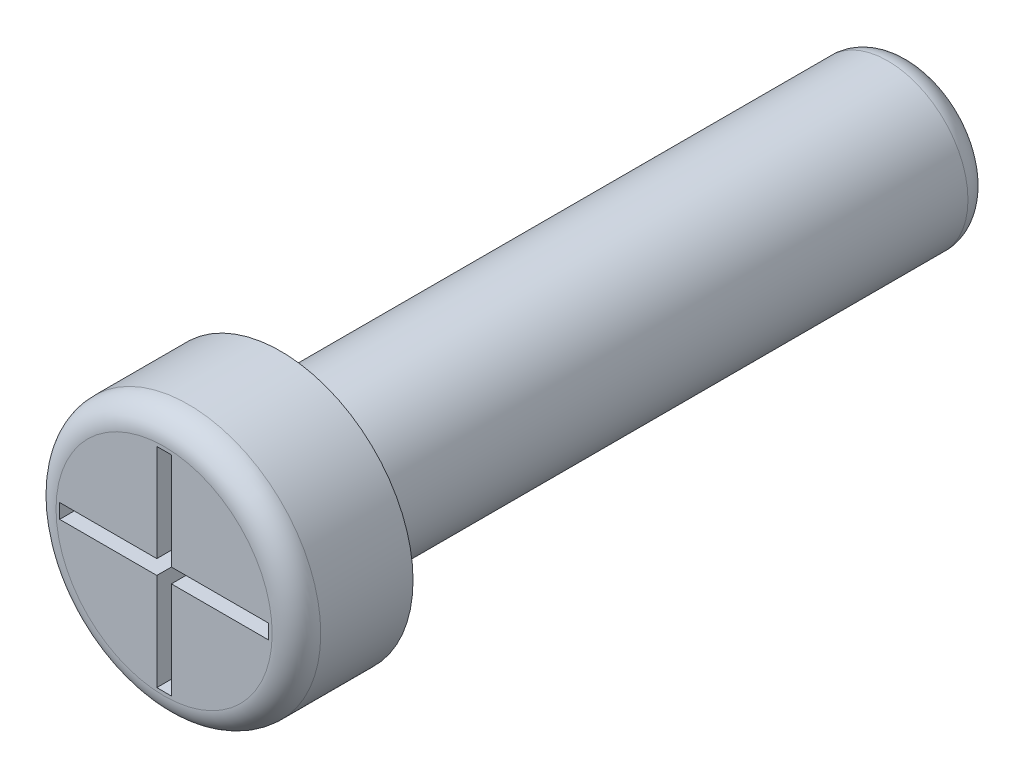
ISO-10303-21;
HEADER;
FILE_DESCRIPTION(('STEP AP214'),'2;1');
FILE_NAME('part.step','',(''),(''),'','','');
FILE_SCHEMA(('AUTOMOTIVE_DESIGN { 1 0 10303 214 1 1 1 1 }'));
ENDSEC;
DATA;
#1=APPLICATION_CONTEXT('core data for automotive mechanical design processes');
#2=APPLICATION_PROTOCOL_DEFINITION('international standard','automotive_design',2000,#1);
#3=PRODUCT_CONTEXT('',#1,'mechanical');
#4=PRODUCT('Part','Part','',(#3));
#5=PRODUCT_RELATED_PRODUCT_CATEGORY('part','',(#4));
#6=PRODUCT_DEFINITION_FORMATION('','',#4);
#7=PRODUCT_DEFINITION_CONTEXT('part definition',#1,'design');
#8=PRODUCT_DEFINITION('design','',#6,#7);
#9=PRODUCT_DEFINITION_SHAPE('','',#8);
#10=(LENGTH_UNIT() NAMED_UNIT(*) SI_UNIT(.MILLI.,.METRE.));
#11=(NAMED_UNIT(*) PLANE_ANGLE_UNIT() SI_UNIT($,.RADIAN.));
#12=(NAMED_UNIT(*) SI_UNIT($,.STERADIAN.) SOLID_ANGLE_UNIT());
#13=UNCERTAINTY_MEASURE_WITH_UNIT(LENGTH_MEASURE(1.E-05),#10,'distance_accuracy_value','');
#14=(GEOMETRIC_REPRESENTATION_CONTEXT(3) GLOBAL_UNCERTAINTY_ASSIGNED_CONTEXT((#13)) GLOBAL_UNIT_ASSIGNED_CONTEXT((#10,
#11,#12)) REPRESENTATION_CONTEXT('',''));
#15=CARTESIAN_POINT('',(0.,0.,0.));
#16=DIRECTION('',(0.,0.,1.));
#17=DIRECTION('',(1.,0.,0.));
#18=AXIS2_PLACEMENT_3D('',#15,#16,#17);
#19=CARTESIAN_POINT('',(0.,0.,2.4));
#20=DIRECTION('',(0.,0.,-1.));
#21=DIRECTION('',(-1.,0.,0.));
#22=AXIS2_PLACEMENT_3D('',#19,#20,#21);
#23=CYLINDRICAL_SURFACE('',#22,2.725);
#24=CARTESIAN_POINT('',(0.,0.,1.9));
#25=DIRECTION('',(0.,0.,1.));
#26=DIRECTION('',(1.,0.,0.));
#27=AXIS2_PLACEMENT_3D('',#24,#25,#26);
#28=CIRCLE('',#27,2.725);
#29=CARTESIAN_POINT('',(2.725,0.,1.9));
#30=VERTEX_POINT('',#29);
#31=EDGE_CURVE('E11',#30,#30,#28,.F.);
#32=ORIENTED_EDGE('',*,*,#31,.T.);
#33=EDGE_LOOP('',(#32));
#34=FACE_BOUND('',#33,.T.);
#35=CARTESIAN_POINT('',(0.,0.,0.));
#36=DIRECTION('',(0.,0.,1.));
#37=DIRECTION('',(1.,0.,0.));
#38=AXIS2_PLACEMENT_3D('',#35,#36,#37);
#39=CIRCLE('',#38,2.725);
#40=CARTESIAN_POINT('',(2.725,0.,0.));
#41=VERTEX_POINT('',#40);
#42=EDGE_CURVE('E189',#41,#41,#39,.T.);
#43=ORIENTED_EDGE('',*,*,#42,.T.);
#44=EDGE_LOOP('',(#43));
#45=FACE_BOUND('',#44,.T.);
#46=ADVANCED_FACE('F33',(#34,#45),#23,.T.);
#47=CARTESIAN_POINT('',(0.,0.,2.4));
#48=DIRECTION('',(0.,0.,1.));
#49=DIRECTION('',(1.,0.,0.));
#50=AXIS2_PLACEMENT_3D('',#47,#48,#49);
#51=PLANE('',#50);
#52=CARTESIAN_POINT('',(0.,0.,2.4));
#53=DIRECTION('',(0.,0.,1.));
#54=DIRECTION('',(1.,0.,0.));
#55=AXIS2_PLACEMENT_3D('',#52,#53,#54);
#56=CIRCLE('',#55,2.225);
#57=CARTESIAN_POINT('',(2.225,0.,2.4));
#58=VERTEX_POINT('',#57);
#59=EDGE_CURVE('E41',#58,#58,#56,.T.);
#60=ORIENTED_EDGE('',*,*,#59,.T.);
#61=EDGE_LOOP('',(#60));
#62=FACE_BOUND('',#61,.T.);
#63=DIRECTION('',(-1.,0.,0.));
#64=VECTOR('',#63,1.);
#65=CARTESIAN_POINT('',(-0.15,2.15,2.4));
#66=LINE('',#65,#64);
#67=CARTESIAN_POINT('',(0.15,2.15,2.4));
#68=VERTEX_POINT('',#67);
#69=CARTESIAN_POINT('',(-0.15,2.15,2.4));
#70=VERTEX_POINT('',#69);
#71=EDGE_CURVE('E48',#68,#70,#66,.T.);
#72=ORIENTED_EDGE('',*,*,#71,.F.);
#73=DIRECTION('',(0.,1.,0.));
#74=VECTOR('',#73,1.);
#75=CARTESIAN_POINT('',(0.15,2.15,2.4));
#76=LINE('',#75,#74);
#77=CARTESIAN_POINT('',(0.15,0.15,2.4));
#78=VERTEX_POINT('',#77);
#79=EDGE_CURVE('E185',#78,#68,#76,.T.);
#80=ORIENTED_EDGE('',*,*,#79,.F.);
#81=DIRECTION('',(-1.,0.,0.));
#82=VECTOR('',#81,1.);
#83=CARTESIAN_POINT('',(0.15,0.15,2.4));
#84=LINE('',#83,#82);
#85=CARTESIAN_POINT('',(2.15,0.15,2.4));
#86=VERTEX_POINT('',#85);
#87=EDGE_CURVE('E183',#86,#78,#84,.T.);
#88=ORIENTED_EDGE('',*,*,#87,.F.);
#89=DIRECTION('',(0.,1.,0.));
#90=VECTOR('',#89,1.);
#91=CARTESIAN_POINT('',(2.15,0.15,2.4));
#92=LINE('',#91,#90);
#93=CARTESIAN_POINT('',(2.15,-0.15,2.4));
#94=VERTEX_POINT('',#93);
#95=EDGE_CURVE('E132',#94,#86,#92,.T.);
#96=ORIENTED_EDGE('',*,*,#95,.F.);
#97=DIRECTION('',(1.,0.,0.));
#98=VECTOR('',#97,1.);
#99=CARTESIAN_POINT('',(2.15,-0.15,2.4));
#100=LINE('',#99,#98);
#101=CARTESIAN_POINT('',(0.15,-0.15,2.4));
#102=VERTEX_POINT('',#101);
#103=EDGE_CURVE('E179',#102,#94,#100,.T.);
#104=ORIENTED_EDGE('',*,*,#103,.F.);
#105=DIRECTION('',(0.,1.,0.));
#106=VECTOR('',#105,1.);
#107=CARTESIAN_POINT('',(0.15,-0.15,2.4));
#108=LINE('',#107,#106);
#109=CARTESIAN_POINT('',(0.15,-2.15,2.4));
#110=VERTEX_POINT('',#109);
#111=EDGE_CURVE('E176',#110,#102,#108,.T.);
#112=ORIENTED_EDGE('',*,*,#111,.F.);
#113=DIRECTION('',(1.,0.,0.));
#114=VECTOR('',#113,1.);
#115=CARTESIAN_POINT('',(0.15,-2.15,2.4));
#116=LINE('',#115,#114);
#117=CARTESIAN_POINT('',(-0.15,-2.15,2.4));
#118=VERTEX_POINT('',#117);
#119=EDGE_CURVE('E173',#118,#110,#116,.T.);
#120=ORIENTED_EDGE('',*,*,#119,.F.);
#121=DIRECTION('',(0.,-1.,0.));
#122=VECTOR('',#121,1.);
#123=CARTESIAN_POINT('',(-0.15,-2.15,2.4));
#124=LINE('',#123,#122);
#125=CARTESIAN_POINT('',(-0.15,-0.15,2.4));
#126=VERTEX_POINT('',#125);
#127=EDGE_CURVE('E170',#126,#118,#124,.T.);
#128=ORIENTED_EDGE('',*,*,#127,.F.);
#129=DIRECTION('',(1.,0.,0.));
#130=VECTOR('',#129,1.);
#131=CARTESIAN_POINT('',(-0.15,-0.15,2.4));
#132=LINE('',#131,#130);
#133=CARTESIAN_POINT('',(-2.15,-0.15,2.4));
#134=VERTEX_POINT('',#133);
#135=EDGE_CURVE('E167',#134,#126,#132,.T.);
#136=ORIENTED_EDGE('',*,*,#135,.F.);
#137=DIRECTION('',(0.,-1.,0.));
#138=VECTOR('',#137,1.);
#139=CARTESIAN_POINT('',(-2.15,-0.15,2.4));
#140=LINE('',#139,#138);
#141=CARTESIAN_POINT('',(-2.15,0.15,2.4));
#142=VERTEX_POINT('',#141);
#143=EDGE_CURVE('E164',#142,#134,#140,.T.);
#144=ORIENTED_EDGE('',*,*,#143,.F.);
#145=DIRECTION('',(-1.,0.,0.));
#146=VECTOR('',#145,1.);
#147=CARTESIAN_POINT('',(-2.15,0.15,2.4));
#148=LINE('',#147,#146);
#149=CARTESIAN_POINT('',(-0.15,0.15,2.4));
#150=VERTEX_POINT('',#149);
#151=EDGE_CURVE('E161',#150,#142,#148,.T.);
#152=ORIENTED_EDGE('',*,*,#151,.F.);
#153=DIRECTION('',(0.,-1.,0.));
#154=VECTOR('',#153,1.);
#155=CARTESIAN_POINT('',(-0.15,0.15,2.4));
#156=LINE('',#155,#154);
#157=EDGE_CURVE('E158',#70,#150,#156,.T.);
#158=ORIENTED_EDGE('',*,*,#157,.F.);
#159=EDGE_LOOP('',(#72,#80,#88,#96,#104,#112,#120,#128,#136,#144,#152,#158));
#160=FACE_BOUND('',#159,.T.);
#161=ADVANCED_FACE('F220',(#62,#160),#51,.T.);
#162=CARTESIAN_POINT('',(0.,0.,0.));
#163=DIRECTION('',(0.,0.,1.));
#164=DIRECTION('',(1.,0.,0.));
#165=AXIS2_PLACEMENT_3D('',#162,#163,#164);
#166=PLANE('',#165);
#167=CARTESIAN_POINT('',(0.,0.,0.));
#168=DIRECTION('',(0.,0.,1.));
#169=DIRECTION('',(1.,0.,0.));
#170=AXIS2_PLACEMENT_3D('',#167,#168,#169);
#171=CIRCLE('',#170,1.65);
#172=CARTESIAN_POINT('',(1.65,0.,0.));
#173=VERTEX_POINT('',#172);
#174=EDGE_CURVE('E209',#173,#173,#171,.F.);
#175=ORIENTED_EDGE('',*,*,#174,.F.);
#176=EDGE_LOOP('',(#175));
#177=FACE_BOUND('',#176,.T.);
#178=ORIENTED_EDGE('',*,*,#42,.F.);
#179=EDGE_LOOP('',(#178));
#180=FACE_BOUND('',#179,.T.);
#181=ADVANCED_FACE('F237',(#177,#180),#166,.F.);
#182=CARTESIAN_POINT('',(0.,0.,-13.));
#183=DIRECTION('',(0.,0.,1.));
#184=DIRECTION('',(1.,0.,0.));
#185=AXIS2_PLACEMENT_3D('',#182,#183,#184);
#186=CYLINDRICAL_SURFACE('',#185,1.65);
#187=CARTESIAN_POINT('',(0.,0.,-12.5));
#188=DIRECTION('',(0.,0.,-1.));
#189=DIRECTION('',(-1.,0.,0.));
#190=AXIS2_PLACEMENT_3D('',#187,#188,#189);
#191=CIRCLE('',#190,1.65);
#192=CARTESIAN_POINT('',(-1.65,0.,-12.5));
#193=VERTEX_POINT('',#192);
#194=EDGE_CURVE('E215',#193,#193,#191,.F.);
#195=ORIENTED_EDGE('',*,*,#194,.T.);
#196=EDGE_LOOP('',(#195));
#197=FACE_BOUND('',#196,.T.);
#198=ORIENTED_EDGE('',*,*,#174,.T.);
#199=EDGE_LOOP('',(#198));
#200=FACE_BOUND('',#199,.T.);
#201=ADVANCED_FACE('F242',(#197,#200),#186,.T.);
#202=CARTESIAN_POINT('',(0.,0.,-13.));
#203=DIRECTION('',(0.,0.,-1.));
#204=DIRECTION('',(-1.,0.,0.));
#205=AXIS2_PLACEMENT_3D('',#202,#203,#204);
#206=PLANE('',#205);
#207=CARTESIAN_POINT('',(0.,0.,-13.));
#208=DIRECTION('',(0.,0.,-1.));
#209=DIRECTION('',(-1.,0.,0.));
#210=AXIS2_PLACEMENT_3D('',#207,#208,#209);
#211=CIRCLE('',#210,1.15);
#212=CARTESIAN_POINT('',(-1.15,0.,-13.));
#213=VERTEX_POINT('',#212);
#214=EDGE_CURVE('E212',#213,#213,#211,.T.);
#215=ORIENTED_EDGE('',*,*,#214,.T.);
#216=EDGE_LOOP('',(#215));
#217=FACE_BOUND('',#216,.T.);
#218=ADVANCED_FACE('F247',(#217),#206,.T.);
#219=CARTESIAN_POINT('',(-0.15,2.15,1.4));
#220=DIRECTION('',(0.,1.,0.));
#221=DIRECTION('',(0.,0.,1.));
#222=AXIS2_PLACEMENT_3D('',#219,#220,#221);
#223=PLANE('',#222);
#224=ORIENTED_EDGE('',*,*,#71,.T.);
#225=DIRECTION('',(0.,0.,1.));
#226=VECTOR('',#225,1.);
#227=CARTESIAN_POINT('',(-0.15,2.15,1.4));
#228=LINE('',#227,#226);
#229=CARTESIAN_POINT('',(-0.15,2.15,1.4));
#230=VERTEX_POINT('',#229);
#231=EDGE_CURVE('E96',#230,#70,#228,.T.);
#232=ORIENTED_EDGE('',*,*,#231,.F.);
#233=DIRECTION('',(-1.,0.,0.));
#234=VECTOR('',#233,1.);
#235=CARTESIAN_POINT('',(-0.15,2.15,1.4));
#236=LINE('',#235,#234);
#237=CARTESIAN_POINT('',(0.15,2.15,1.4));
#238=VERTEX_POINT('',#237);
#239=EDGE_CURVE('E187',#238,#230,#236,.T.);
#240=ORIENTED_EDGE('',*,*,#239,.F.);
#241=DIRECTION('',(0.,0.,1.));
#242=VECTOR('',#241,1.);
#243=CARTESIAN_POINT('',(0.15,2.15,1.4));
#244=LINE('',#243,#242);
#245=EDGE_CURVE('E56',#238,#68,#244,.T.);
#246=ORIENTED_EDGE('',*,*,#245,.T.);
#247=EDGE_LOOP('',(#224,#232,#240,#246));
#248=FACE_BOUND('',#247,.T.);
#249=ADVANCED_FACE('F251',(#248),#223,.F.);
#250=CARTESIAN_POINT('',(0.15,2.15,1.4));
#251=DIRECTION('',(1.,0.,0.));
#252=DIRECTION('',(0.,1.,0.));
#253=AXIS2_PLACEMENT_3D('',#250,#251,#252);
#254=PLANE('',#253);
#255=ORIENTED_EDGE('',*,*,#79,.T.);
#256=ORIENTED_EDGE('',*,*,#245,.F.);
#257=DIRECTION('',(0.,1.,0.));
#258=VECTOR('',#257,1.);
#259=CARTESIAN_POINT('',(0.15,2.15,1.4));
#260=LINE('',#259,#258);
#261=CARTESIAN_POINT('',(0.15,0.15,1.4));
#262=VERTEX_POINT('',#261);
#263=EDGE_CURVE('E144',#262,#238,#260,.T.);
#264=ORIENTED_EDGE('',*,*,#263,.F.);
#265=DIRECTION('',(0.,0.,1.));
#266=VECTOR('',#265,1.);
#267=CARTESIAN_POINT('',(0.15,0.15,1.4));
#268=LINE('',#267,#266);
#269=EDGE_CURVE('E136',#262,#78,#268,.T.);
#270=ORIENTED_EDGE('',*,*,#269,.T.);
#271=EDGE_LOOP('',(#255,#256,#264,#270));
#272=FACE_BOUND('',#271,.T.);
#273=ADVANCED_FACE('F255',(#272),#254,.F.);
#274=CARTESIAN_POINT('',(0.15,0.15,1.4));
#275=DIRECTION('',(0.,1.,0.));
#276=DIRECTION('',(0.,0.,1.));
#277=AXIS2_PLACEMENT_3D('',#274,#275,#276);
#278=PLANE('',#277);
#279=ORIENTED_EDGE('',*,*,#87,.T.);
#280=ORIENTED_EDGE('',*,*,#269,.F.);
#281=DIRECTION('',(-1.,0.,0.));
#282=VECTOR('',#281,1.);
#283=CARTESIAN_POINT('',(0.15,0.15,1.4));
#284=LINE('',#283,#282);
#285=CARTESIAN_POINT('',(2.15,0.15,1.4));
#286=VERTEX_POINT('',#285);
#287=EDGE_CURVE('E140',#286,#262,#284,.T.);
#288=ORIENTED_EDGE('',*,*,#287,.F.);
#289=DIRECTION('',(0.,0.,1.));
#290=VECTOR('',#289,1.);
#291=CARTESIAN_POINT('',(2.15,0.15,1.4));
#292=LINE('',#291,#290);
#293=EDGE_CURVE('E125',#286,#86,#292,.T.);
#294=ORIENTED_EDGE('',*,*,#293,.T.);
#295=EDGE_LOOP('',(#279,#280,#288,#294));
#296=FACE_BOUND('',#295,.T.);
#297=ADVANCED_FACE('F141',(#296),#278,.F.);
#298=CARTESIAN_POINT('',(2.15,0.15,1.4));
#299=DIRECTION('',(1.,0.,0.));
#300=DIRECTION('',(0.,1.,0.));
#301=AXIS2_PLACEMENT_3D('',#298,#299,#300);
#302=PLANE('',#301);
#303=ORIENTED_EDGE('',*,*,#95,.T.);
#304=ORIENTED_EDGE('',*,*,#293,.F.);
#305=DIRECTION('',(0.,1.,0.));
#306=VECTOR('',#305,1.);
#307=CARTESIAN_POINT('',(2.15,0.15,1.4));
#308=LINE('',#307,#306);
#309=CARTESIAN_POINT('',(2.15,-0.15,1.4));
#310=VERTEX_POINT('',#309);
#311=EDGE_CURVE('E129',#310,#286,#308,.T.);
#312=ORIENTED_EDGE('',*,*,#311,.F.);
#313=DIRECTION('',(0.,0.,1.));
#314=VECTOR('',#313,1.);
#315=CARTESIAN_POINT('',(2.15,-0.15,1.4));
#316=LINE('',#315,#314);
#317=EDGE_CURVE('E137',#310,#94,#316,.T.);
#318=ORIENTED_EDGE('',*,*,#317,.T.);
#319=EDGE_LOOP('',(#303,#304,#312,#318));
#320=FACE_BOUND('',#319,.T.);
#321=ADVANCED_FACE('F127',(#320),#302,.F.);
#322=CARTESIAN_POINT('',(2.15,-0.15,1.4));
#323=DIRECTION('',(0.,-1.,0.));
#324=DIRECTION('',(1.,0.,0.));
#325=AXIS2_PLACEMENT_3D('',#322,#323,#324);
#326=PLANE('',#325);
#327=ORIENTED_EDGE('',*,*,#103,.T.);
#328=ORIENTED_EDGE('',*,*,#317,.F.);
#329=DIRECTION('',(1.,0.,0.));
#330=VECTOR('',#329,1.);
#331=CARTESIAN_POINT('',(2.15,-0.15,1.4));
#332=LINE('',#331,#330);
#333=CARTESIAN_POINT('',(0.15,-0.15,1.4));
#334=VERTEX_POINT('',#333);
#335=EDGE_CURVE('E150',#334,#310,#332,.T.);
#336=ORIENTED_EDGE('',*,*,#335,.F.);
#337=DIRECTION('',(0.,0.,1.));
#338=VECTOR('',#337,1.);
#339=CARTESIAN_POINT('',(0.15,-0.15,1.4));
#340=LINE('',#339,#338);
#341=EDGE_CURVE('E192',#334,#102,#340,.T.);
#342=ORIENTED_EDGE('',*,*,#341,.T.);
#343=EDGE_LOOP('',(#327,#328,#336,#342));
#344=FACE_BOUND('',#343,.T.);
#345=ADVANCED_FACE('F283',(#344),#326,.F.);
#346=CARTESIAN_POINT('',(0.15,-0.15,1.4));
#347=DIRECTION('',(1.,0.,0.));
#348=DIRECTION('',(0.,1.,0.));
#349=AXIS2_PLACEMENT_3D('',#346,#347,#348);
#350=PLANE('',#349);
#351=ORIENTED_EDGE('',*,*,#111,.T.);
#352=ORIENTED_EDGE('',*,*,#341,.F.);
#353=DIRECTION('',(0.,1.,0.));
#354=VECTOR('',#353,1.);
#355=CARTESIAN_POINT('',(0.15,-0.15,1.4));
#356=LINE('',#355,#354);
#357=CARTESIAN_POINT('',(0.15,-2.15,1.4));
#358=VERTEX_POINT('',#357);
#359=EDGE_CURVE('E152',#358,#334,#356,.T.);
#360=ORIENTED_EDGE('',*,*,#359,.F.);
#361=DIRECTION('',(0.,0.,1.));
#362=VECTOR('',#361,1.);
#363=CARTESIAN_POINT('',(0.15,-2.15,1.4));
#364=LINE('',#363,#362);
#365=EDGE_CURVE('E194',#358,#110,#364,.T.);
#366=ORIENTED_EDGE('',*,*,#365,.T.);
#367=EDGE_LOOP('',(#351,#352,#360,#366));
#368=FACE_BOUND('',#367,.T.);
#369=ADVANCED_FACE('F279',(#368),#350,.F.);
#370=CARTESIAN_POINT('',(0.15,-2.15,1.4));
#371=DIRECTION('',(0.,-1.,0.));
#372=DIRECTION('',(0.,0.,-1.));
#373=AXIS2_PLACEMENT_3D('',#370,#371,#372);
#374=PLANE('',#373);
#375=ORIENTED_EDGE('',*,*,#119,.T.);
#376=ORIENTED_EDGE('',*,*,#365,.F.);
#377=DIRECTION('',(1.,0.,0.));
#378=VECTOR('',#377,1.);
#379=CARTESIAN_POINT('',(0.15,-2.15,1.4));
#380=LINE('',#379,#378);
#381=CARTESIAN_POINT('',(-0.15,-2.15,1.4));
#382=VERTEX_POINT('',#381);
#383=EDGE_CURVE('E433',#382,#358,#380,.T.);
#384=ORIENTED_EDGE('',*,*,#383,.F.);
#385=DIRECTION('',(0.,0.,1.));
#386=VECTOR('',#385,1.);
#387=CARTESIAN_POINT('',(-0.15,-2.15,1.4));
#388=LINE('',#387,#386);
#389=EDGE_CURVE('E196',#382,#118,#388,.T.);
#390=ORIENTED_EDGE('',*,*,#389,.T.);
#391=EDGE_LOOP('',(#375,#376,#384,#390));
#392=FACE_BOUND('',#391,.T.);
#393=ADVANCED_FACE('F275',(#392),#374,.F.);
#394=CARTESIAN_POINT('',(-0.15,-2.15,1.4));
#395=DIRECTION('',(-1.,0.,0.));
#396=DIRECTION('',(0.,-1.,0.));
#397=AXIS2_PLACEMENT_3D('',#394,#395,#396);
#398=PLANE('',#397);
#399=ORIENTED_EDGE('',*,*,#127,.T.);
#400=ORIENTED_EDGE('',*,*,#389,.F.);
#401=DIRECTION('',(0.,-1.,0.));
#402=VECTOR('',#401,1.);
#403=CARTESIAN_POINT('',(-0.15,-2.15,1.4));
#404=LINE('',#403,#402);
#405=CARTESIAN_POINT('',(-0.15,-0.15,1.4));
#406=VERTEX_POINT('',#405);
#407=EDGE_CURVE('E430',#406,#382,#404,.T.);
#408=ORIENTED_EDGE('',*,*,#407,.F.);
#409=DIRECTION('',(0.,0.,1.));
#410=VECTOR('',#409,1.);
#411=CARTESIAN_POINT('',(-0.15,-0.15,1.4));
#412=LINE('',#411,#410);
#413=EDGE_CURVE('E198',#406,#126,#412,.T.);
#414=ORIENTED_EDGE('',*,*,#413,.T.);
#415=EDGE_LOOP('',(#399,#400,#408,#414));
#416=FACE_BOUND('',#415,.T.);
#417=ADVANCED_FACE('F271',(#416),#398,.F.);
#418=CARTESIAN_POINT('',(-0.15,-0.15,1.4));
#419=DIRECTION('',(0.,-1.,0.));
#420=DIRECTION('',(1.,0.,0.));
#421=AXIS2_PLACEMENT_3D('',#418,#419,#420);
#422=PLANE('',#421);
#423=ORIENTED_EDGE('',*,*,#135,.T.);
#424=ORIENTED_EDGE('',*,*,#413,.F.);
#425=DIRECTION('',(1.,0.,0.));
#426=VECTOR('',#425,1.);
#427=CARTESIAN_POINT('',(-0.15,-0.15,1.4));
#428=LINE('',#427,#426);
#429=CARTESIAN_POINT('',(-2.15,-0.15,1.4));
#430=VERTEX_POINT('',#429);
#431=EDGE_CURVE('E427',#430,#406,#428,.T.);
#432=ORIENTED_EDGE('',*,*,#431,.F.);
#433=DIRECTION('',(0.,0.,1.));
#434=VECTOR('',#433,1.);
#435=CARTESIAN_POINT('',(-2.15,-0.15,1.4));
#436=LINE('',#435,#434);
#437=EDGE_CURVE('E200',#430,#134,#436,.T.);
#438=ORIENTED_EDGE('',*,*,#437,.T.);
#439=EDGE_LOOP('',(#423,#424,#432,#438));
#440=FACE_BOUND('',#439,.T.);
#441=ADVANCED_FACE('F267',(#440),#422,.F.);
#442=CARTESIAN_POINT('',(-2.15,-0.15,1.4));
#443=DIRECTION('',(-1.,0.,0.));
#444=DIRECTION('',(0.,0.,1.));
#445=AXIS2_PLACEMENT_3D('',#442,#443,#444);
#446=PLANE('',#445);
#447=ORIENTED_EDGE('',*,*,#143,.T.);
#448=ORIENTED_EDGE('',*,*,#437,.F.);
#449=DIRECTION('',(0.,-1.,0.));
#450=VECTOR('',#449,1.);
#451=CARTESIAN_POINT('',(-2.15,-0.15,1.4));
#452=LINE('',#451,#450);
#453=CARTESIAN_POINT('',(-2.15,0.15,1.4));
#454=VERTEX_POINT('',#453);
#455=EDGE_CURVE('E424',#454,#430,#452,.T.);
#456=ORIENTED_EDGE('',*,*,#455,.F.);
#457=DIRECTION('',(0.,0.,1.));
#458=VECTOR('',#457,1.);
#459=CARTESIAN_POINT('',(-2.15,0.15,1.4));
#460=LINE('',#459,#458);
#461=EDGE_CURVE('E202',#454,#142,#460,.T.);
#462=ORIENTED_EDGE('',*,*,#461,.T.);
#463=EDGE_LOOP('',(#447,#448,#456,#462));
#464=FACE_BOUND('',#463,.T.);
#465=ADVANCED_FACE('F263',(#464),#446,.F.);
#466=CARTESIAN_POINT('',(-2.15,0.15,1.4));
#467=DIRECTION('',(0.,1.,0.));
#468=DIRECTION('',(0.,0.,1.));
#469=AXIS2_PLACEMENT_3D('',#466,#467,#468);
#470=PLANE('',#469);
#471=ORIENTED_EDGE('',*,*,#151,.T.);
#472=ORIENTED_EDGE('',*,*,#461,.F.);
#473=DIRECTION('',(-1.,0.,0.));
#474=VECTOR('',#473,1.);
#475=CARTESIAN_POINT('',(-2.15,0.15,1.4));
#476=LINE('',#475,#474);
#477=CARTESIAN_POINT('',(-0.15,0.15,1.4));
#478=VERTEX_POINT('',#477);
#479=EDGE_CURVE('E419',#478,#454,#476,.T.);
#480=ORIENTED_EDGE('',*,*,#479,.F.);
#481=DIRECTION('',(0.,0.,1.));
#482=VECTOR('',#481,1.);
#483=CARTESIAN_POINT('',(-0.15,0.15,1.4));
#484=LINE('',#483,#482);
#485=EDGE_CURVE('E204',#478,#150,#484,.T.);
#486=ORIENTED_EDGE('',*,*,#485,.T.);
#487=EDGE_LOOP('',(#471,#472,#480,#486));
#488=FACE_BOUND('',#487,.T.);
#489=ADVANCED_FACE('F259',(#488),#470,.F.);
#490=CARTESIAN_POINT('',(-0.15,0.15,1.4));
#491=DIRECTION('',(-1.,0.,0.));
#492=DIRECTION('',(0.,0.,1.));
#493=AXIS2_PLACEMENT_3D('',#490,#491,#492);
#494=PLANE('',#493);
#495=ORIENTED_EDGE('',*,*,#157,.T.);
#496=ORIENTED_EDGE('',*,*,#485,.F.);
#497=DIRECTION('',(0.,-1.,0.));
#498=VECTOR('',#497,1.);
#499=CARTESIAN_POINT('',(-0.15,0.15,1.4));
#500=LINE('',#499,#498);
#501=EDGE_CURVE('E417',#230,#478,#500,.T.);
#502=ORIENTED_EDGE('',*,*,#501,.F.);
#503=ORIENTED_EDGE('',*,*,#231,.T.);
#504=EDGE_LOOP('',(#495,#496,#502,#503));
#505=FACE_BOUND('',#504,.T.);
#506=ADVANCED_FACE('F256',(#505),#494,.F.);
#507=CARTESIAN_POINT('',(0.,0.,1.4));
#508=DIRECTION('',(0.,0.,-1.));
#509=DIRECTION('',(-1.,0.,0.));
#510=AXIS2_PLACEMENT_3D('',#507,#508,#509);
#511=PLANE('',#510);
#512=ORIENTED_EDGE('',*,*,#239,.T.);
#513=ORIENTED_EDGE('',*,*,#501,.T.);
#514=ORIENTED_EDGE('',*,*,#479,.T.);
#515=ORIENTED_EDGE('',*,*,#455,.T.);
#516=ORIENTED_EDGE('',*,*,#431,.T.);
#517=ORIENTED_EDGE('',*,*,#407,.T.);
#518=ORIENTED_EDGE('',*,*,#383,.T.);
#519=ORIENTED_EDGE('',*,*,#359,.T.);
#520=ORIENTED_EDGE('',*,*,#335,.T.);
#521=ORIENTED_EDGE('',*,*,#311,.T.);
#522=ORIENTED_EDGE('',*,*,#287,.T.);
#523=ORIENTED_EDGE('',*,*,#263,.T.);
#524=EDGE_LOOP('',(#512,#513,#514,#515,#516,#517,#518,#519,#520,#521,#522,#523));
#525=FACE_BOUND('',#524,.T.);
#526=ADVANCED_FACE('F147',(#525),#511,.F.);
#527=CARTESIAN_POINT('',(0.,0.,-12.5));
#528=DIRECTION('',(0.,0.,-1.));
#529=DIRECTION('',(-1.,0.,0.));
#530=AXIS2_PLACEMENT_3D('',#527,#528,#529);
#531=TOROIDAL_SURFACE('',#530,1.15,0.5);
#532=ORIENTED_EDGE('',*,*,#194,.F.);
#533=EDGE_LOOP('',(#532));
#534=FACE_BOUND('',#533,.T.);
#535=ORIENTED_EDGE('',*,*,#214,.F.);
#536=EDGE_LOOP('',(#535));
#537=FACE_BOUND('',#536,.T.);
#538=ADVANCED_FACE('F224',(#534,#537),#531,.T.);
#539=CARTESIAN_POINT('',(0.,0.,1.9));
#540=DIRECTION('',(0.,0.,1.));
#541=DIRECTION('',(1.,0.,0.));
#542=AXIS2_PLACEMENT_3D('',#539,#540,#541);
#543=TOROIDAL_SURFACE('',#542,2.225,0.5);
#544=ORIENTED_EDGE('',*,*,#31,.F.);
#545=EDGE_LOOP('',(#544));
#546=FACE_BOUND('',#545,.T.);
#547=ORIENTED_EDGE('',*,*,#59,.F.);
#548=EDGE_LOOP('',(#547));
#549=FACE_BOUND('',#548,.T.);
#550=ADVANCED_FACE('F35',(#546,#549),#543,.T.);
#551=CLOSED_SHELL('',(#46,#161,#181,#201,#218,#249,#273,#297,#321,#345,#369,#393,#417,#441,#465,
#489,#506,#526,#538,#550));
#552=MANIFOLD_SOLID_BREP('B2',#551);
#553=ADVANCED_BREP_SHAPE_REPRESENTATION('',(#18,#552),#14);
#554=SHAPE_DEFINITION_REPRESENTATION(#9,#553);
ENDSEC;
END-ISO-10303-21;
